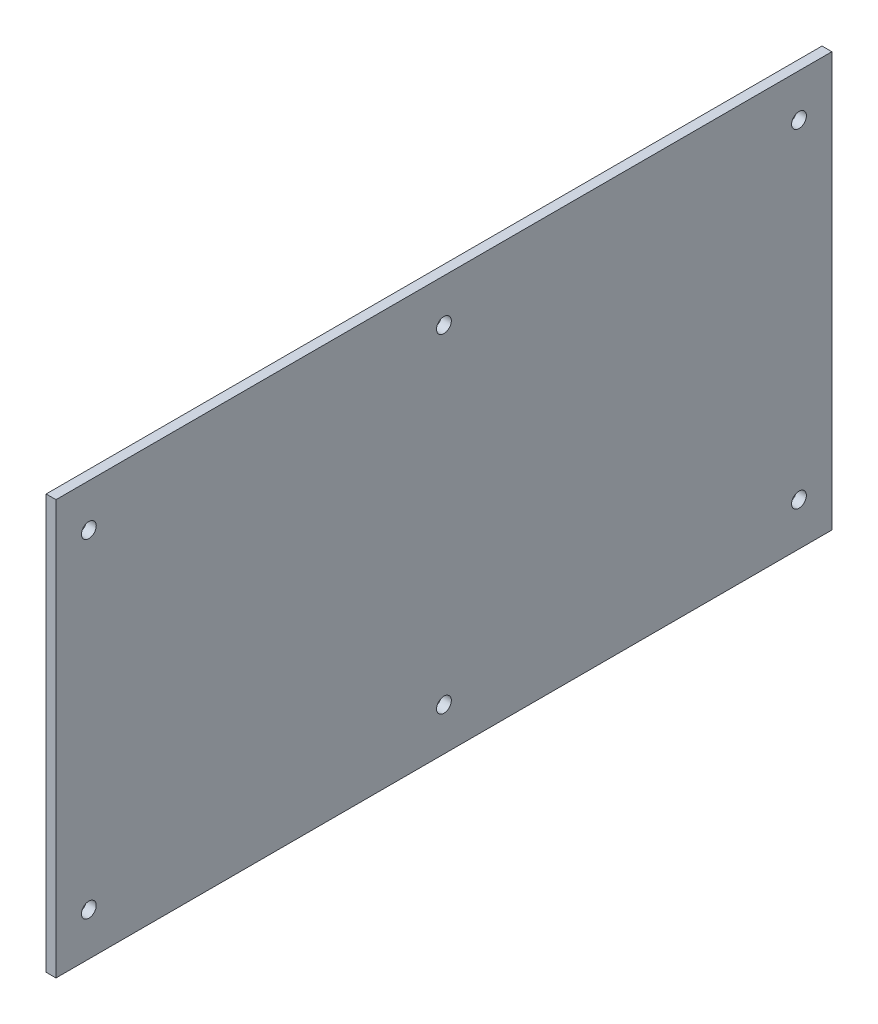
ISO-10303-21;
HEADER;
FILE_DESCRIPTION(('STEP AP214'),'2;1');
FILE_NAME('part.step','',(''),(''),'','','');
FILE_SCHEMA(('AUTOMOTIVE_DESIGN { 1 0 10303 214 1 1 1 1 }'));
ENDSEC;
DATA;
#1=APPLICATION_CONTEXT('core data for automotive mechanical design processes');
#2=APPLICATION_PROTOCOL_DEFINITION('international standard','automotive_design',2000,#1);
#3=PRODUCT_CONTEXT('',#1,'mechanical');
#4=PRODUCT('Part','Part','',(#3));
#5=PRODUCT_RELATED_PRODUCT_CATEGORY('part','',(#4));
#6=PRODUCT_DEFINITION_FORMATION('','',#4);
#7=PRODUCT_DEFINITION_CONTEXT('part definition',#1,'design');
#8=PRODUCT_DEFINITION('design','',#6,#7);
#9=PRODUCT_DEFINITION_SHAPE('','',#8);
#10=(LENGTH_UNIT() NAMED_UNIT(*) SI_UNIT(.MILLI.,.METRE.));
#11=(NAMED_UNIT(*) PLANE_ANGLE_UNIT() SI_UNIT($,.RADIAN.));
#12=(NAMED_UNIT(*) SI_UNIT($,.STERADIAN.) SOLID_ANGLE_UNIT());
#13=UNCERTAINTY_MEASURE_WITH_UNIT(LENGTH_MEASURE(1.E-05),#10,'distance_accuracy_value','');
#14=(GEOMETRIC_REPRESENTATION_CONTEXT(3) GLOBAL_UNCERTAINTY_ASSIGNED_CONTEXT((#13)) GLOBAL_UNIT_ASSIGNED_CONTEXT((#10,
#11,#12)) REPRESENTATION_CONTEXT('',''));
#15=CARTESIAN_POINT('',(0.,0.,0.));
#16=DIRECTION('',(0.,0.,1.));
#17=DIRECTION('',(1.,0.,0.));
#18=AXIS2_PLACEMENT_3D('',#15,#16,#17);
#19=CARTESIAN_POINT('',(23.0000000000001,-2.99999999999922,236.));
#20=DIRECTION('',(0.,1.,0.));
#21=DIRECTION('',(0.,0.,1.));
#22=AXIS2_PLACEMENT_3D('',#19,#20,#21);
#23=PLANE('',#22);
#24=DIRECTION('',(0.,0.,-1.));
#25=VECTOR('',#24,1.);
#26=CARTESIAN_POINT('',(20.0000000000001,-2.99999999999922,236.));
#27=LINE('',#26,#25);
#28=CARTESIAN_POINT('',(20.0000000000001,-2.99999999999922,236.));
#29=VERTEX_POINT('',#28);
#30=CARTESIAN_POINT('',(20.,-3.,-2.00470668110616E-13));
#31=VERTEX_POINT('',#30);
#32=EDGE_CURVE('E97',#29,#31,#27,.T.);
#33=ORIENTED_EDGE('',*,*,#32,.T.);
#34=DIRECTION('',(-1.,0.,0.));
#35=VECTOR('',#34,1.);
#36=CARTESIAN_POINT('',(23.,-3.,-2.01888698199971E-13));
#37=LINE('',#36,#35);
#38=CARTESIAN_POINT('',(23.,-3.,-2.01888698199971E-13));
#39=VERTEX_POINT('',#38);
#40=EDGE_CURVE('E11',#39,#31,#37,.T.);
#41=ORIENTED_EDGE('',*,*,#40,.F.);
#42=DIRECTION('',(0.,0.,-1.));
#43=VECTOR('',#42,1.);
#44=CARTESIAN_POINT('',(23.0000000000001,-2.99999999999922,236.));
#45=LINE('',#44,#43);
#46=CARTESIAN_POINT('',(23.0000000000001,-2.99999999999922,236.));
#47=VERTEX_POINT('',#46);
#48=EDGE_CURVE('E85',#47,#39,#45,.T.);
#49=ORIENTED_EDGE('',*,*,#48,.F.);
#50=DIRECTION('',(-1.,0.,0.));
#51=VECTOR('',#50,1.);
#52=CARTESIAN_POINT('',(23.0000000000001,-2.99999999999922,236.));
#53=LINE('',#52,#51);
#54=EDGE_CURVE('E93',#47,#29,#53,.T.);
#55=ORIENTED_EDGE('',*,*,#54,.T.);
#56=EDGE_LOOP('',(#33,#41,#49,#55));
#57=FACE_BOUND('',#56,.T.);
#58=ADVANCED_FACE('F34',(#57),#23,.F.);
#59=CARTESIAN_POINT('',(23.,-3.,-2.01888698199971E-13));
#60=DIRECTION('',(0.,0.,1.));
#61=DIRECTION('',(0.,-1.,0.));
#62=AXIS2_PLACEMENT_3D('',#59,#60,#61);
#63=PLANE('',#62);
#64=DIRECTION('',(0.,1.,0.));
#65=VECTOR('',#64,1.);
#66=CARTESIAN_POINT('',(20.,-3.,-2.00470668110616E-13));
#67=LINE('',#66,#65);
#68=CARTESIAN_POINT('',(20.,123.,-2.65880083520905E-13));
#69=VERTEX_POINT('',#68);
#70=EDGE_CURVE('E89',#31,#69,#67,.T.);
#71=ORIENTED_EDGE('',*,*,#70,.T.);
#72=DIRECTION('',(-1.,0.,0.));
#73=VECTOR('',#72,1.);
#74=CARTESIAN_POINT('',(23.,123.,-2.6729811361026E-13));
#75=LINE('',#74,#73);
#76=CARTESIAN_POINT('',(23.,123.,-2.6729811361026E-13));
#77=VERTEX_POINT('',#76);
#78=EDGE_CURVE('E42',#77,#69,#75,.T.);
#79=ORIENTED_EDGE('',*,*,#78,.F.);
#80=DIRECTION('',(0.,1.,0.));
#81=VECTOR('',#80,1.);
#82=CARTESIAN_POINT('',(23.,-3.,-2.01888698199971E-13));
#83=LINE('',#82,#81);
#84=EDGE_CURVE('E80',#39,#77,#83,.T.);
#85=ORIENTED_EDGE('',*,*,#84,.F.);
#86=ORIENTED_EDGE('',*,*,#40,.T.);
#87=EDGE_LOOP('',(#71,#79,#85,#86));
#88=FACE_BOUND('',#87,.T.);
#89=ADVANCED_FACE('F88',(#88),#63,.F.);
#90=CARTESIAN_POINT('',(23.,123.,-2.6729811361026E-13));
#91=DIRECTION('',(0.,-1.,0.));
#92=DIRECTION('',(0.,0.,-1.));
#93=AXIS2_PLACEMENT_3D('',#90,#91,#92);
#94=PLANE('',#93);
#95=DIRECTION('',(0.,0.,1.));
#96=VECTOR('',#95,1.);
#97=CARTESIAN_POINT('',(20.,123.,-2.65880083520905E-13));
#98=LINE('',#97,#96);
#99=CARTESIAN_POINT('',(20.0000000000001,123.,236.));
#100=VERTEX_POINT('',#99);
#101=EDGE_CURVE('E67',#69,#100,#98,.T.);
#102=ORIENTED_EDGE('',*,*,#101,.T.);
#103=DIRECTION('',(-1.,0.,0.));
#104=VECTOR('',#103,1.);
#105=CARTESIAN_POINT('',(23.0000000000001,123.,236.));
#106=LINE('',#105,#104);
#107=CARTESIAN_POINT('',(23.0000000000001,123.,236.));
#108=VERTEX_POINT('',#107);
#109=EDGE_CURVE('E90',#108,#100,#106,.T.);
#110=ORIENTED_EDGE('',*,*,#109,.F.);
#111=DIRECTION('',(0.,0.,1.));
#112=VECTOR('',#111,1.);
#113=CARTESIAN_POINT('',(23.,123.,-2.6729811361026E-13));
#114=LINE('',#113,#112);
#115=EDGE_CURVE('E83',#77,#108,#114,.T.);
#116=ORIENTED_EDGE('',*,*,#115,.F.);
#117=ORIENTED_EDGE('',*,*,#78,.T.);
#118=EDGE_LOOP('',(#102,#110,#116,#117));
#119=FACE_BOUND('',#118,.T.);
#120=ADVANCED_FACE('F91',(#119),#94,.F.);
#121=CARTESIAN_POINT('',(23.0000000000001,123.,236.));
#122=DIRECTION('',(0.,0.,-1.));
#123=DIRECTION('',(0.,1.,0.));
#124=AXIS2_PLACEMENT_3D('',#121,#122,#123);
#125=PLANE('',#124);
#126=DIRECTION('',(0.,-1.,0.));
#127=VECTOR('',#126,1.);
#128=CARTESIAN_POINT('',(20.0000000000001,123.,236.));
#129=LINE('',#128,#127);
#130=EDGE_CURVE('E73',#100,#29,#129,.T.);
#131=ORIENTED_EDGE('',*,*,#130,.T.);
#132=ORIENTED_EDGE('',*,*,#54,.F.);
#133=DIRECTION('',(0.,-1.,0.));
#134=VECTOR('',#133,1.);
#135=CARTESIAN_POINT('',(23.0000000000001,123.,236.));
#136=LINE('',#135,#134);
#137=EDGE_CURVE('E50',#108,#47,#136,.T.);
#138=ORIENTED_EDGE('',*,*,#137,.F.);
#139=ORIENTED_EDGE('',*,*,#109,.T.);
#140=EDGE_LOOP('',(#131,#132,#138,#139));
#141=FACE_BOUND('',#140,.T.);
#142=ADVANCED_FACE('F105',(#141),#125,.F.);
#143=CARTESIAN_POINT('',(23.,0.,0.));
#144=DIRECTION('',(1.,0.,0.));
#145=DIRECTION('',(0.,0.,-1.));
#146=AXIS2_PLACEMENT_3D('',#143,#144,#145);
#147=PLANE('',#146);
#148=CARTESIAN_POINT('',(23.0000000000001,10.0000000000008,118.));
#149=DIRECTION('',(1.,0.,0.));
#150=DIRECTION('',(0.,0.,-1.));
#151=AXIS2_PLACEMENT_3D('',#148,#149,#150);
#152=CIRCLE('',#151,2.25);
#153=CARTESIAN_POINT('',(23.0000000000001,10.0000000000008,115.75));
#154=VERTEX_POINT('',#153);
#155=EDGE_CURVE('E141',#154,#154,#152,.T.);
#156=ORIENTED_EDGE('',*,*,#155,.F.);
#157=EDGE_LOOP('',(#156));
#158=FACE_BOUND('',#157,.T.);
#159=CARTESIAN_POINT('',(23.0000000000001,110.,118.));
#160=DIRECTION('',(1.,0.,0.));
#161=DIRECTION('',(0.,0.,-1.));
#162=AXIS2_PLACEMENT_3D('',#159,#160,#161);
#163=CIRCLE('',#162,2.25000000000001);
#164=CARTESIAN_POINT('',(23.0000000000001,110.,115.75));
#165=VERTEX_POINT('',#164);
#166=EDGE_CURVE('E135',#165,#165,#163,.T.);
#167=ORIENTED_EDGE('',*,*,#166,.F.);
#168=EDGE_LOOP('',(#167));
#169=FACE_BOUND('',#168,.T.);
#170=CARTESIAN_POINT('',(23.0000000000001,10.0000000000007,226.));
#171=DIRECTION('',(1.,0.,0.));
#172=DIRECTION('',(0.,0.,-1.));
#173=AXIS2_PLACEMENT_3D('',#170,#171,#172);
#174=CIRCLE('',#173,2.25000000000001);
#175=CARTESIAN_POINT('',(23.0000000000001,10.0000000000007,223.75));
#176=VERTEX_POINT('',#175);
#177=EDGE_CURVE('E129',#176,#176,#174,.T.);
#178=ORIENTED_EDGE('',*,*,#177,.F.);
#179=EDGE_LOOP('',(#178));
#180=FACE_BOUND('',#179,.T.);
#181=CARTESIAN_POINT('',(23.0000000000001,110.,226.));
#182=DIRECTION('',(1.,0.,0.));
#183=DIRECTION('',(0.,0.,-1.));
#184=AXIS2_PLACEMENT_3D('',#181,#182,#183);
#185=CIRCLE('',#184,2.25000000000001);
#186=CARTESIAN_POINT('',(23.0000000000001,110.,223.75));
#187=VERTEX_POINT('',#186);
#188=EDGE_CURVE('E123',#187,#187,#185,.T.);
#189=ORIENTED_EDGE('',*,*,#188,.F.);
#190=EDGE_LOOP('',(#189));
#191=FACE_BOUND('',#190,.T.);
#192=CARTESIAN_POINT('',(23.,10.0000000000011,9.9999999999998));
#193=DIRECTION('',(1.,0.,0.));
#194=DIRECTION('',(0.,0.,-1.));
#195=AXIS2_PLACEMENT_3D('',#192,#193,#194);
#196=CIRCLE('',#195,2.25000000000001);
#197=CARTESIAN_POINT('',(23.,10.0000000000011,7.74999999999979));
#198=VERTEX_POINT('',#197);
#199=EDGE_CURVE('E117',#198,#198,#196,.T.);
#200=ORIENTED_EDGE('',*,*,#199,.F.);
#201=EDGE_LOOP('',(#200));
#202=FACE_BOUND('',#201,.T.);
#203=CARTESIAN_POINT('',(23.,110.,9.9999999999998));
#204=DIRECTION('',(1.,0.,0.));
#205=DIRECTION('',(0.,0.,-1.));
#206=AXIS2_PLACEMENT_3D('',#203,#204,#205);
#207=CIRCLE('',#206,2.25000000000001);
#208=CARTESIAN_POINT('',(23.,110.,7.74999999999979));
#209=VERTEX_POINT('',#208);
#210=EDGE_CURVE('E111',#209,#209,#207,.T.);
#211=ORIENTED_EDGE('',*,*,#210,.F.);
#212=EDGE_LOOP('',(#211));
#213=FACE_BOUND('',#212,.T.);
#214=ORIENTED_EDGE('',*,*,#48,.T.);
#215=ORIENTED_EDGE('',*,*,#84,.T.);
#216=ORIENTED_EDGE('',*,*,#115,.T.);
#217=ORIENTED_EDGE('',*,*,#137,.T.);
#218=EDGE_LOOP('',(#214,#215,#216,#217));
#219=FACE_BOUND('',#218,.T.);
#220=ADVANCED_FACE('F81',(#158,#169,#180,#191,#202,#213,#219),#147,.T.);
#221=CARTESIAN_POINT('',(20.,0.,0.));
#222=DIRECTION('',(1.,0.,0.));
#223=DIRECTION('',(0.,0.,-1.));
#224=AXIS2_PLACEMENT_3D('',#221,#222,#223);
#225=PLANE('',#224);
#226=CARTESIAN_POINT('',(19.9999999999999,10.0000000000008,118.));
#227=DIRECTION('',(1.,0.,0.));
#228=DIRECTION('',(0.,0.,-1.));
#229=AXIS2_PLACEMENT_3D('',#226,#227,#228);
#230=CIRCLE('',#229,2.25);
#231=CARTESIAN_POINT('',(19.9999999999999,10.0000000000008,115.75));
#232=VERTEX_POINT('',#231);
#233=EDGE_CURVE('E138',#232,#232,#230,.T.);
#234=ORIENTED_EDGE('',*,*,#233,.T.);
#235=EDGE_LOOP('',(#234));
#236=FACE_BOUND('',#235,.T.);
#237=CARTESIAN_POINT('',(19.9999999999999,110.,118.));
#238=DIRECTION('',(1.,0.,0.));
#239=DIRECTION('',(0.,0.,-1.));
#240=AXIS2_PLACEMENT_3D('',#237,#238,#239);
#241=CIRCLE('',#240,2.25000000000001);
#242=CARTESIAN_POINT('',(19.9999999999999,110.,115.75));
#243=VERTEX_POINT('',#242);
#244=EDGE_CURVE('E132',#243,#243,#241,.T.);
#245=ORIENTED_EDGE('',*,*,#244,.T.);
#246=EDGE_LOOP('',(#245));
#247=FACE_BOUND('',#246,.T.);
#248=CARTESIAN_POINT('',(20.,10.0000000000007,226.));
#249=DIRECTION('',(1.,0.,0.));
#250=DIRECTION('',(0.,0.,-1.));
#251=AXIS2_PLACEMENT_3D('',#248,#249,#250);
#252=CIRCLE('',#251,2.25000000000001);
#253=CARTESIAN_POINT('',(20.,10.0000000000007,223.75));
#254=VERTEX_POINT('',#253);
#255=EDGE_CURVE('E126',#254,#254,#252,.T.);
#256=ORIENTED_EDGE('',*,*,#255,.T.);
#257=EDGE_LOOP('',(#256));
#258=FACE_BOUND('',#257,.T.);
#259=CARTESIAN_POINT('',(20.,110.,226.));
#260=DIRECTION('',(1.,0.,0.));
#261=DIRECTION('',(0.,0.,-1.));
#262=AXIS2_PLACEMENT_3D('',#259,#260,#261);
#263=CIRCLE('',#262,2.25000000000001);
#264=CARTESIAN_POINT('',(20.,110.,223.75));
#265=VERTEX_POINT('',#264);
#266=EDGE_CURVE('E120',#265,#265,#263,.T.);
#267=ORIENTED_EDGE('',*,*,#266,.T.);
#268=EDGE_LOOP('',(#267));
#269=FACE_BOUND('',#268,.T.);
#270=CARTESIAN_POINT('',(19.9999999999999,10.0000000000011,9.99999999999981));
#271=DIRECTION('',(1.,0.,0.));
#272=DIRECTION('',(0.,0.,-1.));
#273=AXIS2_PLACEMENT_3D('',#270,#271,#272);
#274=CIRCLE('',#273,2.25000000000001);
#275=CARTESIAN_POINT('',(19.9999999999999,10.0000000000011,7.7499999999998));
#276=VERTEX_POINT('',#275);
#277=EDGE_CURVE('E114',#276,#276,#274,.T.);
#278=ORIENTED_EDGE('',*,*,#277,.T.);
#279=EDGE_LOOP('',(#278));
#280=FACE_BOUND('',#279,.T.);
#281=CARTESIAN_POINT('',(19.9999999999999,110.,9.9999999999998));
#282=DIRECTION('',(1.,0.,0.));
#283=DIRECTION('',(0.,0.,-1.));
#284=AXIS2_PLACEMENT_3D('',#281,#282,#283);
#285=CIRCLE('',#284,2.25000000000001);
#286=CARTESIAN_POINT('',(19.9999999999999,110.,7.74999999999979));
#287=VERTEX_POINT('',#286);
#288=EDGE_CURVE('E100',#287,#287,#285,.T.);
#289=ORIENTED_EDGE('',*,*,#288,.T.);
#290=EDGE_LOOP('',(#289));
#291=FACE_BOUND('',#290,.T.);
#292=ORIENTED_EDGE('',*,*,#32,.F.);
#293=ORIENTED_EDGE('',*,*,#130,.F.);
#294=ORIENTED_EDGE('',*,*,#101,.F.);
#295=ORIENTED_EDGE('',*,*,#70,.F.);
#296=EDGE_LOOP('',(#292,#293,#294,#295));
#297=FACE_BOUND('',#296,.T.);
#298=ADVANCED_FACE('F108',(#236,#247,#258,#269,#280,#291,#297),#225,.F.);
#299=CARTESIAN_POINT('',(19.9999999999999,110.,9.9999999999998));
#300=DIRECTION('',(1.,0.,0.));
#301=DIRECTION('',(0.,0.,-1.));
#302=AXIS2_PLACEMENT_3D('',#299,#300,#301);
#303=CYLINDRICAL_SURFACE('',#302,2.25000000000001);
#304=ORIENTED_EDGE('',*,*,#288,.F.);
#305=EDGE_LOOP('',(#304));
#306=FACE_BOUND('',#305,.T.);
#307=ORIENTED_EDGE('',*,*,#210,.T.);
#308=EDGE_LOOP('',(#307));
#309=FACE_BOUND('',#308,.T.);
#310=ADVANCED_FACE('F169',(#306,#309),#303,.F.);
#311=CARTESIAN_POINT('',(19.9999999999999,10.0000000000011,9.99999999999981));
#312=DIRECTION('',(1.,0.,0.));
#313=DIRECTION('',(0.,0.,-1.));
#314=AXIS2_PLACEMENT_3D('',#311,#312,#313);
#315=CYLINDRICAL_SURFACE('',#314,2.25000000000001);
#316=ORIENTED_EDGE('',*,*,#277,.F.);
#317=EDGE_LOOP('',(#316));
#318=FACE_BOUND('',#317,.T.);
#319=ORIENTED_EDGE('',*,*,#199,.T.);
#320=EDGE_LOOP('',(#319));
#321=FACE_BOUND('',#320,.T.);
#322=ADVANCED_FACE('F171',(#318,#321),#315,.F.);
#323=CARTESIAN_POINT('',(20.,110.,226.));
#324=DIRECTION('',(1.,0.,0.));
#325=DIRECTION('',(0.,0.,-1.));
#326=AXIS2_PLACEMENT_3D('',#323,#324,#325);
#327=CYLINDRICAL_SURFACE('',#326,2.25000000000001);
#328=ORIENTED_EDGE('',*,*,#266,.F.);
#329=EDGE_LOOP('',(#328));
#330=FACE_BOUND('',#329,.T.);
#331=ORIENTED_EDGE('',*,*,#188,.T.);
#332=EDGE_LOOP('',(#331));
#333=FACE_BOUND('',#332,.T.);
#334=ADVANCED_FACE('F178',(#330,#333),#327,.F.);
#335=CARTESIAN_POINT('',(20.,10.0000000000007,226.));
#336=DIRECTION('',(1.,0.,0.));
#337=DIRECTION('',(0.,0.,-1.));
#338=AXIS2_PLACEMENT_3D('',#335,#336,#337);
#339=CYLINDRICAL_SURFACE('',#338,2.25000000000001);
#340=ORIENTED_EDGE('',*,*,#255,.F.);
#341=EDGE_LOOP('',(#340));
#342=FACE_BOUND('',#341,.T.);
#343=ORIENTED_EDGE('',*,*,#177,.T.);
#344=EDGE_LOOP('',(#343));
#345=FACE_BOUND('',#344,.T.);
#346=ADVANCED_FACE('F224',(#342,#345),#339,.F.);
#347=CARTESIAN_POINT('',(19.9999999999999,110.,118.));
#348=DIRECTION('',(1.,0.,0.));
#349=DIRECTION('',(0.,0.,-1.));
#350=AXIS2_PLACEMENT_3D('',#347,#348,#349);
#351=CYLINDRICAL_SURFACE('',#350,2.25000000000001);
#352=ORIENTED_EDGE('',*,*,#244,.F.);
#353=EDGE_LOOP('',(#352));
#354=FACE_BOUND('',#353,.T.);
#355=ORIENTED_EDGE('',*,*,#166,.T.);
#356=EDGE_LOOP('',(#355));
#357=FACE_BOUND('',#356,.T.);
#358=ADVANCED_FACE('F152',(#354,#357),#351,.F.);
#359=CARTESIAN_POINT('',(19.9999999999999,10.0000000000008,118.));
#360=DIRECTION('',(1.,0.,0.));
#361=DIRECTION('',(0.,0.,-1.));
#362=AXIS2_PLACEMENT_3D('',#359,#360,#361);
#363=CYLINDRICAL_SURFACE('',#362,2.25);
#364=ORIENTED_EDGE('',*,*,#233,.F.);
#365=EDGE_LOOP('',(#364));
#366=FACE_BOUND('',#365,.T.);
#367=ORIENTED_EDGE('',*,*,#155,.T.);
#368=EDGE_LOOP('',(#367));
#369=FACE_BOUND('',#368,.T.);
#370=ADVANCED_FACE('F149',(#366,#369),#363,.F.);
#371=CLOSED_SHELL('',(#58,#89,#120,#142,#220,#298,#310,#322,#334,#346,#358,#370));
#372=MANIFOLD_SOLID_BREP('B2',#371);
#373=ADVANCED_BREP_SHAPE_REPRESENTATION('',(#18,#372),#14);
#374=SHAPE_DEFINITION_REPRESENTATION(#9,#373);
ENDSEC;
END-ISO-10303-21;
